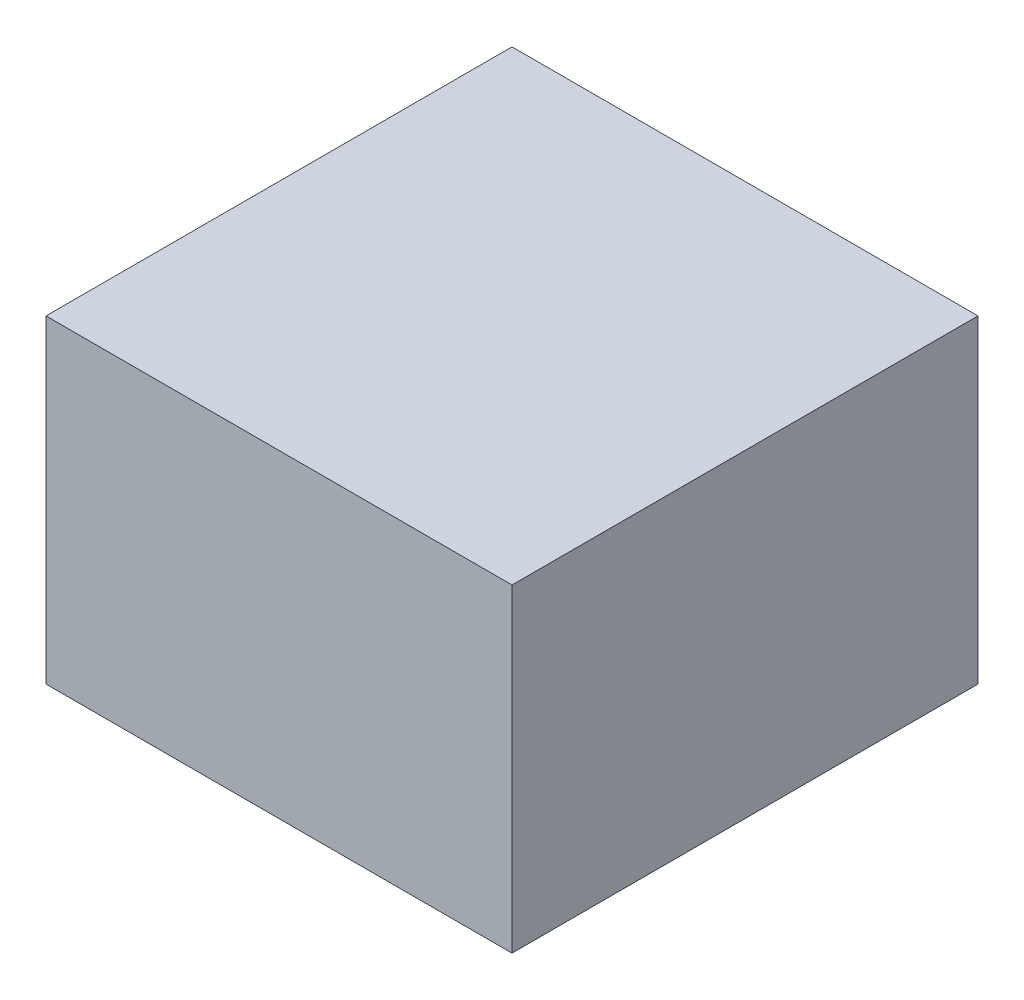
ISO-10303-21;
HEADER;
FILE_DESCRIPTION(('STEP AP214'),'2;1');
FILE_NAME('part.step','',(''),(''),'','','');
FILE_SCHEMA(('AUTOMOTIVE_DESIGN { 1 0 10303 214 1 1 1 1 }'));
ENDSEC;
DATA;
#1=APPLICATION_CONTEXT('core data for automotive mechanical design processes');
#2=APPLICATION_PROTOCOL_DEFINITION('international standard','automotive_design',2000,#1);
#3=PRODUCT_CONTEXT('',#1,'mechanical');
#4=PRODUCT('Part','Part','',(#3));
#5=PRODUCT_RELATED_PRODUCT_CATEGORY('part','',(#4));
#6=PRODUCT_DEFINITION_FORMATION('','',#4);
#7=PRODUCT_DEFINITION_CONTEXT('part definition',#1,'design');
#8=PRODUCT_DEFINITION('design','',#6,#7);
#9=PRODUCT_DEFINITION_SHAPE('','',#8);
#10=(LENGTH_UNIT() NAMED_UNIT(*) SI_UNIT(.MILLI.,.METRE.));
#11=(NAMED_UNIT(*) PLANE_ANGLE_UNIT() SI_UNIT($,.RADIAN.));
#12=(NAMED_UNIT(*) SI_UNIT($,.STERADIAN.) SOLID_ANGLE_UNIT());
#13=UNCERTAINTY_MEASURE_WITH_UNIT(LENGTH_MEASURE(1.E-05),#10,'distance_accuracy_value','');
#14=(GEOMETRIC_REPRESENTATION_CONTEXT(3) GLOBAL_UNCERTAINTY_ASSIGNED_CONTEXT((#13)) GLOBAL_UNIT_ASSIGNED_CONTEXT((#10,
#11,#12)) REPRESENTATION_CONTEXT('',''));
#15=CARTESIAN_POINT('',(0.,0.,0.));
#16=DIRECTION('',(0.,0.,1.));
#17=DIRECTION('',(1.,0.,0.));
#18=AXIS2_PLACEMENT_3D('',#15,#16,#17);
#19=CARTESIAN_POINT('',(-57.6554150147543,130.,-150.));
#20=DIRECTION('',(1.,0.,0.));
#21=DIRECTION('',(0.,0.,-1.));
#22=AXIS2_PLACEMENT_3D('',#19,#20,#21);
#23=PLANE('',#22);
#24=DIRECTION('',(0.,0.,1.));
#25=VECTOR('',#24,1.);
#26=CARTESIAN_POINT('',(-57.6554150147543,0.,-150.));
#27=LINE('',#26,#25);
#28=CARTESIAN_POINT('',(-57.6554150147543,0.,-150.));
#29=VERTEX_POINT('',#28);
#30=CARTESIAN_POINT('',(-57.6554150147543,0.,40.));
#31=VERTEX_POINT('',#30);
#32=EDGE_CURVE('E139',#29,#31,#27,.T.);
#33=ORIENTED_EDGE('',*,*,#32,.T.);
#34=DIRECTION('',(0.,-1.,0.));
#35=VECTOR('',#34,1.);
#36=CARTESIAN_POINT('',(-57.6554150147543,130.,40.));
#37=LINE('',#36,#35);
#38=CARTESIAN_POINT('',(-57.6554150147543,130.,40.));
#39=VERTEX_POINT('',#38);
#40=EDGE_CURVE('E144',#39,#31,#37,.T.);
#41=ORIENTED_EDGE('',*,*,#40,.F.);
#42=DIRECTION('',(0.,0.,1.));
#43=VECTOR('',#42,1.);
#44=CARTESIAN_POINT('',(-57.6554150147543,130.,-150.));
#45=LINE('',#44,#43);
#46=CARTESIAN_POINT('',(-57.6554150147543,130.,-150.));
#47=VERTEX_POINT('',#46);
#48=EDGE_CURVE('E133',#47,#39,#45,.T.);
#49=ORIENTED_EDGE('',*,*,#48,.F.);
#50=DIRECTION('',(0.,-1.,0.));
#51=VECTOR('',#50,1.);
#52=CARTESIAN_POINT('',(-57.6554150147543,130.,-150.));
#53=LINE('',#52,#51);
#54=EDGE_CURVE('E41',#47,#29,#53,.T.);
#55=ORIENTED_EDGE('',*,*,#54,.T.);
#56=EDGE_LOOP('',(#33,#41,#49,#55));
#57=FACE_BOUND('',#56,.T.);
#58=DIRECTION('',(0.,1.,0.));
#59=VECTOR('',#58,1.);
#60=CARTESIAN_POINT('',(-57.6554150147543,10.,30.));
#61=LINE('',#60,#59);
#62=CARTESIAN_POINT('',(-57.6554150147543,10.,30.));
#63=VERTEX_POINT('',#62);
#64=CARTESIAN_POINT('',(-57.6554150147543,120.,30.));
#65=VERTEX_POINT('',#64);
#66=EDGE_CURVE('E48',#63,#65,#61,.T.);
#67=ORIENTED_EDGE('',*,*,#66,.F.);
#68=DIRECTION('',(0.,0.,1.));
#69=VECTOR('',#68,1.);
#70=CARTESIAN_POINT('',(-57.6554150147543,10.,30.));
#71=LINE('',#70,#69);
#72=CARTESIAN_POINT('',(-57.6554150147543,9.99999999999998,-140.));
#73=VERTEX_POINT('',#72);
#74=EDGE_CURVE('E52',#73,#63,#71,.T.);
#75=ORIENTED_EDGE('',*,*,#74,.F.);
#76=DIRECTION('',(0.,-1.,0.));
#77=VECTOR('',#76,1.);
#78=CARTESIAN_POINT('',(-57.6554150147543,9.99999999999998,-140.));
#79=LINE('',#78,#77);
#80=CARTESIAN_POINT('',(-57.6554150147543,120.,-140.));
#81=VERTEX_POINT('',#80);
#82=EDGE_CURVE('E318',#81,#73,#79,.T.);
#83=ORIENTED_EDGE('',*,*,#82,.F.);
#84=DIRECTION('',(0.,0.,-1.));
#85=VECTOR('',#84,1.);
#86=CARTESIAN_POINT('',(-57.6554150147543,120.,30.));
#87=LINE('',#86,#85);
#88=EDGE_CURVE('E316',#65,#81,#87,.T.);
#89=ORIENTED_EDGE('',*,*,#88,.F.);
#90=EDGE_LOOP('',(#67,#75,#83,#89));
#91=FACE_BOUND('',#90,.T.);
#92=ADVANCED_FACE('F33',(#57,#91),#23,.F.);
#93=CARTESIAN_POINT('',(132.344584985246,130.,-150.));
#94=DIRECTION('',(-1.,0.,0.));
#95=DIRECTION('',(0.,0.,1.));
#96=AXIS2_PLACEMENT_3D('',#93,#94,#95);
#97=PLANE('',#96);
#98=DIRECTION('',(0.,0.,-1.));
#99=VECTOR('',#98,1.);
#100=CARTESIAN_POINT('',(132.344584985246,0.,-150.));
#101=LINE('',#100,#99);
#102=CARTESIAN_POINT('',(132.344584985246,0.,40.));
#103=VERTEX_POINT('',#102);
#104=CARTESIAN_POINT('',(132.344584985246,0.,-150.));
#105=VERTEX_POINT('',#104);
#106=EDGE_CURVE('E118',#103,#105,#101,.T.);
#107=ORIENTED_EDGE('',*,*,#106,.T.);
#108=DIRECTION('',(0.,-1.,0.));
#109=VECTOR('',#108,1.);
#110=CARTESIAN_POINT('',(132.344584985246,130.,-150.));
#111=LINE('',#110,#109);
#112=CARTESIAN_POINT('',(132.344584985246,130.,-150.));
#113=VERTEX_POINT('',#112);
#114=EDGE_CURVE('E11',#113,#105,#111,.T.);
#115=ORIENTED_EDGE('',*,*,#114,.F.);
#116=DIRECTION('',(0.,0.,-1.));
#117=VECTOR('',#116,1.);
#118=CARTESIAN_POINT('',(132.344584985246,130.,-150.));
#119=LINE('',#118,#117);
#120=CARTESIAN_POINT('',(132.344584985246,130.,40.));
#121=VERTEX_POINT('',#120);
#122=EDGE_CURVE('E127',#121,#113,#119,.T.);
#123=ORIENTED_EDGE('',*,*,#122,.F.);
#124=DIRECTION('',(0.,-1.,0.));
#125=VECTOR('',#124,1.);
#126=CARTESIAN_POINT('',(132.344584985246,130.,40.));
#127=LINE('',#126,#125);
#128=EDGE_CURVE('E136',#121,#103,#127,.T.);
#129=ORIENTED_EDGE('',*,*,#128,.T.);
#130=EDGE_LOOP('',(#107,#115,#123,#129));
#131=FACE_BOUND('',#130,.T.);
#132=ADVANCED_FACE('F35',(#131),#97,.F.);
#133=CARTESIAN_POINT('',(-57.6554150147543,130.,-150.));
#134=DIRECTION('',(0.,0.,1.));
#135=DIRECTION('',(1.,0.,0.));
#136=AXIS2_PLACEMENT_3D('',#133,#134,#135);
#137=PLANE('',#136);
#138=DIRECTION('',(-1.,0.,0.));
#139=VECTOR('',#138,1.);
#140=CARTESIAN_POINT('',(-57.6554150147543,0.,-150.));
#141=LINE('',#140,#139);
#142=EDGE_CURVE('E121',#105,#29,#141,.T.);
#143=ORIENTED_EDGE('',*,*,#142,.T.);
#144=ORIENTED_EDGE('',*,*,#54,.F.);
#145=DIRECTION('',(-1.,0.,0.));
#146=VECTOR('',#145,1.);
#147=CARTESIAN_POINT('',(-57.6554150147543,130.,-150.));
#148=LINE('',#147,#146);
#149=EDGE_CURVE('E130',#113,#47,#148,.T.);
#150=ORIENTED_EDGE('',*,*,#149,.F.);
#151=ORIENTED_EDGE('',*,*,#114,.T.);
#152=EDGE_LOOP('',(#143,#144,#150,#151));
#153=FACE_BOUND('',#152,.T.);
#154=ADVANCED_FACE('F166',(#153),#137,.F.);
#155=CARTESIAN_POINT('',(-57.6554150147543,130.,40.));
#156=DIRECTION('',(0.,0.,-1.));
#157=DIRECTION('',(-1.,0.,0.));
#158=AXIS2_PLACEMENT_3D('',#155,#156,#157);
#159=PLANE('',#158);
#160=DIRECTION('',(1.,0.,0.));
#161=VECTOR('',#160,1.);
#162=CARTESIAN_POINT('',(-57.6554150147543,0.,40.));
#163=LINE('',#162,#161);
#164=EDGE_CURVE('E131',#31,#103,#163,.T.);
#165=ORIENTED_EDGE('',*,*,#164,.T.);
#166=ORIENTED_EDGE('',*,*,#128,.F.);
#167=DIRECTION('',(1.,0.,0.));
#168=VECTOR('',#167,1.);
#169=CARTESIAN_POINT('',(-57.6554150147543,130.,40.));
#170=LINE('',#169,#168);
#171=EDGE_CURVE('E135',#39,#121,#170,.T.);
#172=ORIENTED_EDGE('',*,*,#171,.F.);
#173=ORIENTED_EDGE('',*,*,#40,.T.);
#174=EDGE_LOOP('',(#165,#166,#172,#173));
#175=FACE_BOUND('',#174,.T.);
#176=ADVANCED_FACE('F159',(#175),#159,.F.);
#177=CARTESIAN_POINT('',(0.,130.,0.));
#178=DIRECTION('',(0.,1.,0.));
#179=DIRECTION('',(0.,0.,1.));
#180=AXIS2_PLACEMENT_3D('',#177,#178,#179);
#181=PLANE('',#180);
#182=ORIENTED_EDGE('',*,*,#122,.T.);
#183=ORIENTED_EDGE('',*,*,#149,.T.);
#184=ORIENTED_EDGE('',*,*,#48,.T.);
#185=ORIENTED_EDGE('',*,*,#171,.T.);
#186=EDGE_LOOP('',(#182,#183,#184,#185));
#187=FACE_BOUND('',#186,.T.);
#188=ADVANCED_FACE('F165',(#187),#181,.T.);
#189=CARTESIAN_POINT('',(0.,0.,0.));
#190=DIRECTION('',(0.,1.,0.));
#191=DIRECTION('',(0.,0.,1.));
#192=AXIS2_PLACEMENT_3D('',#189,#190,#191);
#193=PLANE('',#192);
#194=ORIENTED_EDGE('',*,*,#106,.F.);
#195=ORIENTED_EDGE('',*,*,#164,.F.);
#196=ORIENTED_EDGE('',*,*,#32,.F.);
#197=ORIENTED_EDGE('',*,*,#142,.F.);
#198=EDGE_LOOP('',(#194,#195,#196,#197));
#199=FACE_BOUND('',#198,.T.);
#200=ADVANCED_FACE('F156',(#199),#193,.F.);
#201=CARTESIAN_POINT('',(-59.6554150147543,10.,30.));
#202=DIRECTION('',(0.,0.,-1.));
#203=DIRECTION('',(-1.,0.,0.));
#204=AXIS2_PLACEMENT_3D('',#201,#202,#203);
#205=PLANE('',#204);
#206=ORIENTED_EDGE('',*,*,#66,.T.);
#207=DIRECTION('',(1.,0.,0.));
#208=VECTOR('',#207,1.);
#209=CARTESIAN_POINT('',(-59.6554150147543,120.,30.));
#210=LINE('',#209,#208);
#211=CARTESIAN_POINT('',(-59.6554150147543,120.,30.));
#212=VERTEX_POINT('',#211);
#213=EDGE_CURVE('E101',#212,#65,#210,.T.);
#214=ORIENTED_EDGE('',*,*,#213,.F.);
#215=DIRECTION('',(0.,1.,0.));
#216=VECTOR('',#215,1.);
#217=CARTESIAN_POINT('',(-59.6554150147543,10.,30.));
#218=LINE('',#217,#216);
#219=CARTESIAN_POINT('',(-59.6554150147543,10.,30.));
#220=VERTEX_POINT('',#219);
#221=EDGE_CURVE('E107',#220,#212,#218,.T.);
#222=ORIENTED_EDGE('',*,*,#221,.F.);
#223=DIRECTION('',(1.,0.,0.));
#224=VECTOR('',#223,1.);
#225=CARTESIAN_POINT('',(-59.6554150147543,10.,30.));
#226=LINE('',#225,#224);
#227=EDGE_CURVE('E314',#220,#63,#226,.T.);
#228=ORIENTED_EDGE('',*,*,#227,.T.);
#229=EDGE_LOOP('',(#206,#214,#222,#228));
#230=FACE_BOUND('',#229,.T.);
#231=ADVANCED_FACE('F117',(#230),#205,.F.);
#232=CARTESIAN_POINT('',(-59.6554150147543,120.,30.));
#233=DIRECTION('',(0.,-1.,0.));
#234=DIRECTION('',(0.,0.,-1.));
#235=AXIS2_PLACEMENT_3D('',#232,#233,#234);
#236=PLANE('',#235);
#237=ORIENTED_EDGE('',*,*,#88,.T.);
#238=DIRECTION('',(1.,0.,0.));
#239=VECTOR('',#238,1.);
#240=CARTESIAN_POINT('',(-59.6554150147543,120.,-140.));
#241=LINE('',#240,#239);
#242=CARTESIAN_POINT('',(-59.6554150147543,120.,-140.));
#243=VERTEX_POINT('',#242);
#244=EDGE_CURVE('E103',#243,#81,#241,.T.);
#245=ORIENTED_EDGE('',*,*,#244,.F.);
#246=DIRECTION('',(0.,0.,-1.));
#247=VECTOR('',#246,1.);
#248=CARTESIAN_POINT('',(-59.6554150147543,120.,30.));
#249=LINE('',#248,#247);
#250=EDGE_CURVE('E96',#212,#243,#249,.T.);
#251=ORIENTED_EDGE('',*,*,#250,.F.);
#252=ORIENTED_EDGE('',*,*,#213,.T.);
#253=EDGE_LOOP('',(#237,#245,#251,#252));
#254=FACE_BOUND('',#253,.T.);
#255=ADVANCED_FACE('F99',(#254),#236,.F.);
#256=CARTESIAN_POINT('',(-59.6554150147543,9.99999999999998,-140.));
#257=DIRECTION('',(0.,0.,1.));
#258=DIRECTION('',(1.,0.,0.));
#259=AXIS2_PLACEMENT_3D('',#256,#257,#258);
#260=PLANE('',#259);
#261=ORIENTED_EDGE('',*,*,#82,.T.);
#262=DIRECTION('',(1.,0.,0.));
#263=VECTOR('',#262,1.);
#264=CARTESIAN_POINT('',(-59.6554150147543,9.99999999999998,-140.));
#265=LINE('',#264,#263);
#266=CARTESIAN_POINT('',(-59.6554150147543,9.99999999999998,-140.));
#267=VERTEX_POINT('',#266);
#268=EDGE_CURVE('E123',#267,#73,#265,.T.);
#269=ORIENTED_EDGE('',*,*,#268,.F.);
#270=DIRECTION('',(0.,-1.,0.));
#271=VECTOR('',#270,1.);
#272=CARTESIAN_POINT('',(-59.6554150147543,9.99999999999998,-140.));
#273=LINE('',#272,#271);
#274=EDGE_CURVE('E106',#243,#267,#273,.T.);
#275=ORIENTED_EDGE('',*,*,#274,.F.);
#276=ORIENTED_EDGE('',*,*,#244,.T.);
#277=EDGE_LOOP('',(#261,#269,#275,#276));
#278=FACE_BOUND('',#277,.T.);
#279=ADVANCED_FACE('F186',(#278),#260,.F.);
#280=CARTESIAN_POINT('',(-59.6554150147543,10.,30.));
#281=DIRECTION('',(0.,1.,0.));
#282=DIRECTION('',(0.,0.,1.));
#283=AXIS2_PLACEMENT_3D('',#280,#281,#282);
#284=PLANE('',#283);
#285=ORIENTED_EDGE('',*,*,#74,.T.);
#286=ORIENTED_EDGE('',*,*,#227,.F.);
#287=DIRECTION('',(0.,0.,1.));
#288=VECTOR('',#287,1.);
#289=CARTESIAN_POINT('',(-59.6554150147543,10.,30.));
#290=LINE('',#289,#288);
#291=EDGE_CURVE('E112',#267,#220,#290,.T.);
#292=ORIENTED_EDGE('',*,*,#291,.F.);
#293=ORIENTED_EDGE('',*,*,#268,.T.);
#294=EDGE_LOOP('',(#285,#286,#292,#293));
#295=FACE_BOUND('',#294,.T.);
#296=ADVANCED_FACE('F189',(#295),#284,.F.);
#297=CARTESIAN_POINT('',(-59.6554150147543,0.,0.));
#298=DIRECTION('',(-1.,0.,0.));
#299=DIRECTION('',(0.,0.,1.));
#300=AXIS2_PLACEMENT_3D('',#297,#298,#299);
#301=PLANE('',#300);
#302=CARTESIAN_POINT('',(-59.6554150147543,105.,-85.));
#303=DIRECTION('',(-1.,0.,0.));
#304=DIRECTION('',(0.,0.,1.));
#305=AXIS2_PLACEMENT_3D('',#302,#303,#304);
#306=CIRCLE('',#305,4.00000000000002);
#307=CARTESIAN_POINT('',(-59.6554150147543,105.,-81.));
#308=VERTEX_POINT('',#307);
#309=EDGE_CURVE('E266',#308,#308,#306,.T.);
#310=ORIENTED_EDGE('',*,*,#309,.F.);
#311=EDGE_LOOP('',(#310));
#312=FACE_BOUND('',#311,.T.);
#313=CARTESIAN_POINT('',(-59.6554150147543,105.,-65.));
#314=DIRECTION('',(-1.,0.,0.));
#315=DIRECTION('',(0.,0.,1.));
#316=AXIS2_PLACEMENT_3D('',#313,#314,#315);
#317=CIRCLE('',#316,4.00000000000001);
#318=CARTESIAN_POINT('',(-59.6554150147543,105.,-61.));
#319=VERTEX_POINT('',#318);
#320=EDGE_CURVE('E265',#319,#319,#317,.T.);
#321=ORIENTED_EDGE('',*,*,#320,.F.);
#322=EDGE_LOOP('',(#321));
#323=FACE_BOUND('',#322,.T.);
#324=CARTESIAN_POINT('',(-59.6554150147543,105.,-45.));
#325=DIRECTION('',(-1.,0.,0.));
#326=DIRECTION('',(0.,0.,1.));
#327=AXIS2_PLACEMENT_3D('',#324,#325,#326);
#328=CIRCLE('',#327,4.00000000000001);
#329=CARTESIAN_POINT('',(-59.6554150147543,105.,-41.));
#330=VERTEX_POINT('',#329);
#331=EDGE_CURVE('E275',#330,#330,#328,.T.);
#332=ORIENTED_EDGE('',*,*,#331,.F.);
#333=EDGE_LOOP('',(#332));
#334=FACE_BOUND('',#333,.T.);
#335=CARTESIAN_POINT('',(-59.6554150147543,25.,-85.));
#336=DIRECTION('',(-1.,0.,0.));
#337=DIRECTION('',(0.,0.,1.));
#338=AXIS2_PLACEMENT_3D('',#335,#336,#337);
#339=CIRCLE('',#338,4.00000000000001);
#340=CARTESIAN_POINT('',(-59.6554150147543,25.,-81.));
#341=VERTEX_POINT('',#340);
#342=EDGE_CURVE('E280',#341,#341,#339,.T.);
#343=ORIENTED_EDGE('',*,*,#342,.F.);
#344=EDGE_LOOP('',(#343));
#345=FACE_BOUND('',#344,.T.);
#346=CARTESIAN_POINT('',(-59.6554150147543,25.,-65.));
#347=DIRECTION('',(-1.,0.,0.));
#348=DIRECTION('',(0.,0.,1.));
#349=AXIS2_PLACEMENT_3D('',#346,#347,#348);
#350=CIRCLE('',#349,4.00000000000001);
#351=CARTESIAN_POINT('',(-59.6554150147543,25.,-61.));
#352=VERTEX_POINT('',#351);
#353=EDGE_CURVE('E286',#352,#352,#350,.T.);
#354=ORIENTED_EDGE('',*,*,#353,.F.);
#355=EDGE_LOOP('',(#354));
#356=FACE_BOUND('',#355,.T.);
#357=CARTESIAN_POINT('',(-59.6554150147543,105.,-25.));
#358=DIRECTION('',(-1.,0.,0.));
#359=DIRECTION('',(0.,0.,1.));
#360=AXIS2_PLACEMENT_3D('',#357,#358,#359);
#361=CIRCLE('',#360,4.00000000000001);
#362=CARTESIAN_POINT('',(-59.6554150147543,105.,-21.));
#363=VERTEX_POINT('',#362);
#364=EDGE_CURVE('E292',#363,#363,#361,.T.);
#365=ORIENTED_EDGE('',*,*,#364,.F.);
#366=EDGE_LOOP('',(#365));
#367=FACE_BOUND('',#366,.T.);
#368=CARTESIAN_POINT('',(-59.6554150147543,25.,-45.));
#369=DIRECTION('',(-1.,0.,0.));
#370=DIRECTION('',(0.,0.,1.));
#371=AXIS2_PLACEMENT_3D('',#368,#369,#370);
#372=CIRCLE('',#371,4.);
#373=CARTESIAN_POINT('',(-59.6554150147543,25.,-41.));
#374=VERTEX_POINT('',#373);
#375=EDGE_CURVE('E298',#374,#374,#372,.T.);
#376=ORIENTED_EDGE('',*,*,#375,.F.);
#377=EDGE_LOOP('',(#376));
#378=FACE_BOUND('',#377,.T.);
#379=CARTESIAN_POINT('',(-59.6554150147543,25.,-25.));
#380=DIRECTION('',(-1.,0.,0.));
#381=DIRECTION('',(0.,0.,1.));
#382=AXIS2_PLACEMENT_3D('',#379,#380,#381);
#383=CIRCLE('',#382,4.);
#384=CARTESIAN_POINT('',(-59.6554150147543,25.,-21.));
#385=VERTEX_POINT('',#384);
#386=EDGE_CURVE('E304',#385,#385,#383,.T.);
#387=ORIENTED_EDGE('',*,*,#386,.F.);
#388=EDGE_LOOP('',(#387));
#389=FACE_BOUND('',#388,.T.);
#390=ORIENTED_EDGE('',*,*,#221,.T.);
#391=ORIENTED_EDGE('',*,*,#250,.T.);
#392=ORIENTED_EDGE('',*,*,#274,.T.);
#393=ORIENTED_EDGE('',*,*,#291,.T.);
#394=EDGE_LOOP('',(#390,#391,#392,#393));
#395=FACE_BOUND('',#394,.T.);
#396=ADVANCED_FACE('F110',(#312,#323,#334,#345,#356,#367,#378,#389,#395),#301,.T.);
#397=CARTESIAN_POINT('',(-67.6554150147543,25.,-25.));
#398=DIRECTION('',(1.,0.,0.));
#399=DIRECTION('',(0.,0.,-1.));
#400=AXIS2_PLACEMENT_3D('',#397,#398,#399);
#401=CYLINDRICAL_SURFACE('',#400,4.);
#402=CARTESIAN_POINT('',(-67.6554150147543,25.,-25.));
#403=DIRECTION('',(-1.,0.,0.));
#404=DIRECTION('',(0.,0.,1.));
#405=AXIS2_PLACEMENT_3D('',#402,#403,#404);
#406=CIRCLE('',#405,4.);
#407=CARTESIAN_POINT('',(-67.6554150147543,25.,-21.));
#408=VERTEX_POINT('',#407);
#409=EDGE_CURVE('E307',#408,#408,#406,.T.);
#410=ORIENTED_EDGE('',*,*,#409,.F.);
#411=EDGE_LOOP('',(#410));
#412=FACE_BOUND('',#411,.T.);
#413=ORIENTED_EDGE('',*,*,#386,.T.);
#414=EDGE_LOOP('',(#413));
#415=FACE_BOUND('',#414,.T.);
#416=ADVANCED_FACE('F196',(#412,#415),#401,.T.);
#417=CARTESIAN_POINT('',(-67.6554150147543,25.,-25.));
#418=DIRECTION('',(-1.,0.,0.));
#419=DIRECTION('',(0.,0.,1.));
#420=AXIS2_PLACEMENT_3D('',#417,#418,#419);
#421=PLANE('',#420);
#422=ORIENTED_EDGE('',*,*,#409,.T.);
#423=EDGE_LOOP('',(#422));
#424=FACE_BOUND('',#423,.T.);
#425=ADVANCED_FACE('F200',(#424),#421,.T.);
#426=CARTESIAN_POINT('',(-67.6554150147543,25.,-45.));
#427=DIRECTION('',(1.,0.,0.));
#428=DIRECTION('',(0.,0.,-1.));
#429=AXIS2_PLACEMENT_3D('',#426,#427,#428);
#430=CYLINDRICAL_SURFACE('',#429,4.);
#431=CARTESIAN_POINT('',(-67.6554150147543,25.,-45.));
#432=DIRECTION('',(-1.,0.,0.));
#433=DIRECTION('',(0.,0.,1.));
#434=AXIS2_PLACEMENT_3D('',#431,#432,#433);
#435=CIRCLE('',#434,4.);
#436=CARTESIAN_POINT('',(-67.6554150147543,25.,-41.));
#437=VERTEX_POINT('',#436);
#438=EDGE_CURVE('E301',#437,#437,#435,.T.);
#439=ORIENTED_EDGE('',*,*,#438,.F.);
#440=EDGE_LOOP('',(#439));
#441=FACE_BOUND('',#440,.T.);
#442=ORIENTED_EDGE('',*,*,#375,.T.);
#443=EDGE_LOOP('',(#442));
#444=FACE_BOUND('',#443,.T.);
#445=ADVANCED_FACE('F204',(#441,#444),#430,.T.);
#446=CARTESIAN_POINT('',(-67.6554150147543,25.,-45.));
#447=DIRECTION('',(-1.,0.,0.));
#448=DIRECTION('',(0.,0.,1.));
#449=AXIS2_PLACEMENT_3D('',#446,#447,#448);
#450=PLANE('',#449);
#451=ORIENTED_EDGE('',*,*,#438,.T.);
#452=EDGE_LOOP('',(#451));
#453=FACE_BOUND('',#452,.T.);
#454=ADVANCED_FACE('F208',(#453),#450,.T.);
#455=CARTESIAN_POINT('',(-67.6554150147543,105.,-25.));
#456=DIRECTION('',(1.,0.,0.));
#457=DIRECTION('',(0.,0.,-1.));
#458=AXIS2_PLACEMENT_3D('',#455,#456,#457);
#459=CYLINDRICAL_SURFACE('',#458,4.00000000000001);
#460=CARTESIAN_POINT('',(-67.6554150147543,105.,-25.));
#461=DIRECTION('',(-1.,0.,0.));
#462=DIRECTION('',(0.,0.,1.));
#463=AXIS2_PLACEMENT_3D('',#460,#461,#462);
#464=CIRCLE('',#463,4.00000000000001);
#465=CARTESIAN_POINT('',(-67.6554150147543,105.,-21.));
#466=VERTEX_POINT('',#465);
#467=EDGE_CURVE('E295',#466,#466,#464,.T.);
#468=ORIENTED_EDGE('',*,*,#467,.F.);
#469=EDGE_LOOP('',(#468));
#470=FACE_BOUND('',#469,.T.);
#471=ORIENTED_EDGE('',*,*,#364,.T.);
#472=EDGE_LOOP('',(#471));
#473=FACE_BOUND('',#472,.T.);
#474=ADVANCED_FACE('F212',(#470,#473),#459,.T.);
#475=CARTESIAN_POINT('',(-67.6554150147543,105.,-25.));
#476=DIRECTION('',(-1.,0.,0.));
#477=DIRECTION('',(0.,0.,1.));
#478=AXIS2_PLACEMENT_3D('',#475,#476,#477);
#479=PLANE('',#478);
#480=ORIENTED_EDGE('',*,*,#467,.T.);
#481=EDGE_LOOP('',(#480));
#482=FACE_BOUND('',#481,.T.);
#483=ADVANCED_FACE('F216',(#482),#479,.T.);
#484=CARTESIAN_POINT('',(-67.6554150147543,25.,-65.));
#485=DIRECTION('',(1.,0.,0.));
#486=DIRECTION('',(0.,0.,-1.));
#487=AXIS2_PLACEMENT_3D('',#484,#485,#486);
#488=CYLINDRICAL_SURFACE('',#487,4.00000000000001);
#489=CARTESIAN_POINT('',(-67.6554150147543,25.,-65.));
#490=DIRECTION('',(-1.,0.,0.));
#491=DIRECTION('',(0.,0.,1.));
#492=AXIS2_PLACEMENT_3D('',#489,#490,#491);
#493=CIRCLE('',#492,4.00000000000001);
#494=CARTESIAN_POINT('',(-67.6554150147543,25.,-61.));
#495=VERTEX_POINT('',#494);
#496=EDGE_CURVE('E289',#495,#495,#493,.T.);
#497=ORIENTED_EDGE('',*,*,#496,.F.);
#498=EDGE_LOOP('',(#497));
#499=FACE_BOUND('',#498,.T.);
#500=ORIENTED_EDGE('',*,*,#353,.T.);
#501=EDGE_LOOP('',(#500));
#502=FACE_BOUND('',#501,.T.);
#503=ADVANCED_FACE('F220',(#499,#502),#488,.T.);
#504=CARTESIAN_POINT('',(-67.6554150147543,25.,-65.));
#505=DIRECTION('',(-1.,0.,0.));
#506=DIRECTION('',(0.,0.,1.));
#507=AXIS2_PLACEMENT_3D('',#504,#505,#506);
#508=PLANE('',#507);
#509=ORIENTED_EDGE('',*,*,#496,.T.);
#510=EDGE_LOOP('',(#509));
#511=FACE_BOUND('',#510,.T.);
#512=ADVANCED_FACE('F224',(#511),#508,.T.);
#513=CARTESIAN_POINT('',(-67.6554150147543,25.,-85.));
#514=DIRECTION('',(1.,0.,0.));
#515=DIRECTION('',(0.,0.,-1.));
#516=AXIS2_PLACEMENT_3D('',#513,#514,#515);
#517=CYLINDRICAL_SURFACE('',#516,4.00000000000001);
#518=CARTESIAN_POINT('',(-67.6554150147543,25.,-85.));
#519=DIRECTION('',(-1.,0.,0.));
#520=DIRECTION('',(0.,0.,1.));
#521=AXIS2_PLACEMENT_3D('',#518,#519,#520);
#522=CIRCLE('',#521,4.00000000000001);
#523=CARTESIAN_POINT('',(-67.6554150147543,25.,-81.));
#524=VERTEX_POINT('',#523);
#525=EDGE_CURVE('E283',#524,#524,#522,.T.);
#526=ORIENTED_EDGE('',*,*,#525,.F.);
#527=EDGE_LOOP('',(#526));
#528=FACE_BOUND('',#527,.T.);
#529=ORIENTED_EDGE('',*,*,#342,.T.);
#530=EDGE_LOOP('',(#529));
#531=FACE_BOUND('',#530,.T.);
#532=ADVANCED_FACE('F228',(#528,#531),#517,.T.);
#533=CARTESIAN_POINT('',(-67.6554150147543,25.,-85.));
#534=DIRECTION('',(-1.,0.,0.));
#535=DIRECTION('',(0.,0.,1.));
#536=AXIS2_PLACEMENT_3D('',#533,#534,#535);
#537=PLANE('',#536);
#538=ORIENTED_EDGE('',*,*,#525,.T.);
#539=EDGE_LOOP('',(#538));
#540=FACE_BOUND('',#539,.T.);
#541=ADVANCED_FACE('F232',(#540),#537,.T.);
#542=CARTESIAN_POINT('',(-67.6554150147543,105.,-45.));
#543=DIRECTION('',(1.,0.,0.));
#544=DIRECTION('',(0.,0.,-1.));
#545=AXIS2_PLACEMENT_3D('',#542,#543,#544);
#546=CYLINDRICAL_SURFACE('',#545,4.00000000000001);
#547=CARTESIAN_POINT('',(-67.6554150147543,105.,-45.));
#548=DIRECTION('',(-1.,0.,0.));
#549=DIRECTION('',(0.,0.,1.));
#550=AXIS2_PLACEMENT_3D('',#547,#548,#549);
#551=CIRCLE('',#550,4.00000000000001);
#552=CARTESIAN_POINT('',(-67.6554150147543,105.,-41.));
#553=VERTEX_POINT('',#552);
#554=EDGE_CURVE('E277',#553,#553,#551,.T.);
#555=ORIENTED_EDGE('',*,*,#554,.F.);
#556=EDGE_LOOP('',(#555));
#557=FACE_BOUND('',#556,.T.);
#558=ORIENTED_EDGE('',*,*,#331,.T.);
#559=EDGE_LOOP('',(#558));
#560=FACE_BOUND('',#559,.T.);
#561=ADVANCED_FACE('F236',(#557,#560),#546,.T.);
#562=CARTESIAN_POINT('',(-67.6554150147543,105.,-45.));
#563=DIRECTION('',(-1.,0.,0.));
#564=DIRECTION('',(0.,0.,1.));
#565=AXIS2_PLACEMENT_3D('',#562,#563,#564);
#566=PLANE('',#565);
#567=ORIENTED_EDGE('',*,*,#554,.T.);
#568=EDGE_LOOP('',(#567));
#569=FACE_BOUND('',#568,.T.);
#570=ADVANCED_FACE('F240',(#569),#566,.T.);
#571=CARTESIAN_POINT('',(-67.6554150147543,105.,-65.));
#572=DIRECTION('',(1.,0.,0.));
#573=DIRECTION('',(0.,0.,-1.));
#574=AXIS2_PLACEMENT_3D('',#571,#572,#573);
#575=CYLINDRICAL_SURFACE('',#574,4.00000000000001);
#576=CARTESIAN_POINT('',(-67.6554150147543,105.,-65.));
#577=DIRECTION('',(-1.,0.,0.));
#578=DIRECTION('',(0.,0.,1.));
#579=AXIS2_PLACEMENT_3D('',#576,#577,#578);
#580=CIRCLE('',#579,4.00000000000001);
#581=CARTESIAN_POINT('',(-67.6554150147543,105.,-61.));
#582=VERTEX_POINT('',#581);
#583=EDGE_CURVE('E269',#582,#582,#580,.T.);
#584=ORIENTED_EDGE('',*,*,#583,.F.);
#585=EDGE_LOOP('',(#584));
#586=FACE_BOUND('',#585,.T.);
#587=ORIENTED_EDGE('',*,*,#320,.T.);
#588=EDGE_LOOP('',(#587));
#589=FACE_BOUND('',#588,.T.);
#590=ADVANCED_FACE('F244',(#586,#589),#575,.T.);
#591=CARTESIAN_POINT('',(-67.6554150147543,105.,-65.));
#592=DIRECTION('',(-1.,0.,0.));
#593=DIRECTION('',(0.,0.,1.));
#594=AXIS2_PLACEMENT_3D('',#591,#592,#593);
#595=PLANE('',#594);
#596=ORIENTED_EDGE('',*,*,#583,.T.);
#597=EDGE_LOOP('',(#596));
#598=FACE_BOUND('',#597,.T.);
#599=ADVANCED_FACE('F248',(#598),#595,.T.);
#600=CARTESIAN_POINT('',(-67.6554150147543,105.,-85.));
#601=DIRECTION('',(1.,0.,0.));
#602=DIRECTION('',(0.,0.,-1.));
#603=AXIS2_PLACEMENT_3D('',#600,#601,#602);
#604=CYLINDRICAL_SURFACE('',#603,4.00000000000002);
#605=CARTESIAN_POINT('',(-67.6554150147543,105.,-85.));
#606=DIRECTION('',(-1.,0.,0.));
#607=DIRECTION('',(0.,0.,1.));
#608=AXIS2_PLACEMENT_3D('',#605,#606,#607);
#609=CIRCLE('',#608,4.00000000000002);
#610=CARTESIAN_POINT('',(-67.6554150147543,105.,-81.));
#611=VERTEX_POINT('',#610);
#612=EDGE_CURVE('E264',#611,#611,#609,.T.);
#613=ORIENTED_EDGE('',*,*,#612,.F.);
#614=EDGE_LOOP('',(#613));
#615=FACE_BOUND('',#614,.T.);
#616=ORIENTED_EDGE('',*,*,#309,.T.);
#617=EDGE_LOOP('',(#616));
#618=FACE_BOUND('',#617,.T.);
#619=ADVANCED_FACE('F252',(#615,#618),#604,.T.);
#620=CARTESIAN_POINT('',(-67.6554150147543,105.,-85.));
#621=DIRECTION('',(-1.,0.,0.));
#622=DIRECTION('',(0.,0.,1.));
#623=AXIS2_PLACEMENT_3D('',#620,#621,#622);
#624=PLANE('',#623);
#625=ORIENTED_EDGE('',*,*,#612,.T.);
#626=EDGE_LOOP('',(#625));
#627=FACE_BOUND('',#626,.T.);
#628=ADVANCED_FACE('F256',(#627),#624,.T.);
#629=CLOSED_SHELL('',(#92,#132,#154,#176,#188,#200,#231,#255,#279,#296,#396,#416,#425,#445,#454,
#474,#483,#503,#512,#532,#541,#561,#570,#590,#599,#619,#628));
#630=MANIFOLD_SOLID_BREP('B2',#629);
#631=ADVANCED_BREP_SHAPE_REPRESENTATION('',(#18,#630),#14);
#632=SHAPE_DEFINITION_REPRESENTATION(#9,#631);
ENDSEC;
END-ISO-10303-21;
